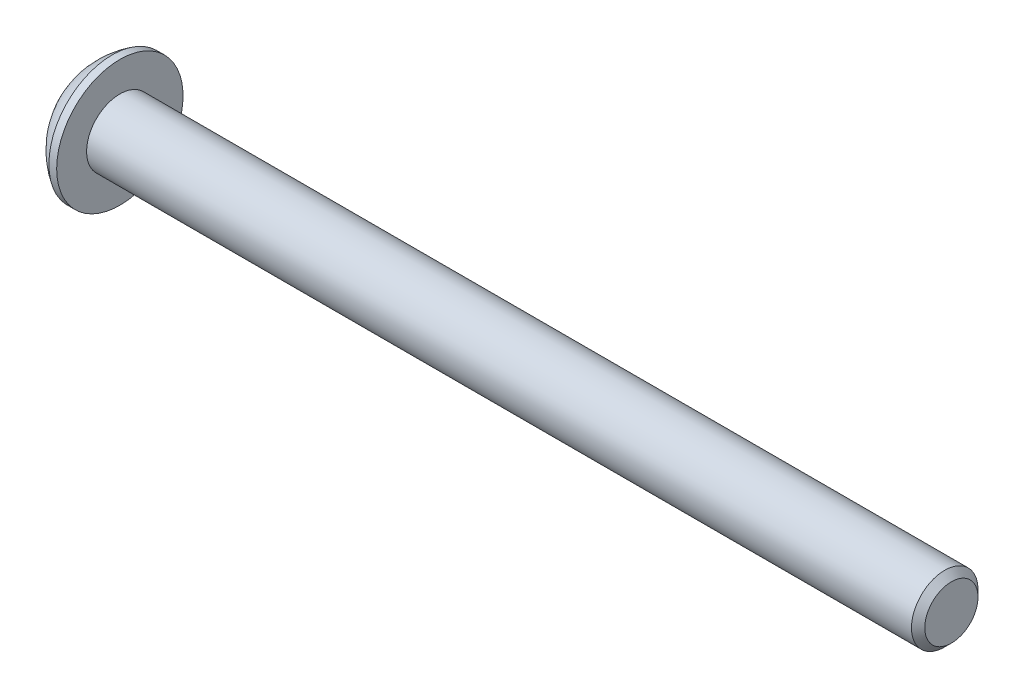
ISO-10303-21;
HEADER;
FILE_DESCRIPTION(('STEP AP214'),'2;1');
FILE_NAME('part.step','',(''),(''),'','','');
FILE_SCHEMA(('AUTOMOTIVE_DESIGN { 1 0 10303 214 1 1 1 1 }'));
ENDSEC;
DATA;
#1=APPLICATION_CONTEXT('core data for automotive mechanical design processes');
#2=APPLICATION_PROTOCOL_DEFINITION('international standard','automotive_design',2000,#1);
#3=PRODUCT_CONTEXT('',#1,'mechanical');
#4=PRODUCT('Part','Part','',(#3));
#5=PRODUCT_RELATED_PRODUCT_CATEGORY('part','',(#4));
#6=PRODUCT_DEFINITION_FORMATION('','',#4);
#7=PRODUCT_DEFINITION_CONTEXT('part definition',#1,'design');
#8=PRODUCT_DEFINITION('design','',#6,#7);
#9=PRODUCT_DEFINITION_SHAPE('','',#8);
#10=(LENGTH_UNIT() NAMED_UNIT(*) SI_UNIT(.MILLI.,.METRE.));
#11=(NAMED_UNIT(*) PLANE_ANGLE_UNIT() SI_UNIT($,.RADIAN.));
#12=(NAMED_UNIT(*) SI_UNIT($,.STERADIAN.) SOLID_ANGLE_UNIT());
#13=UNCERTAINTY_MEASURE_WITH_UNIT(LENGTH_MEASURE(1.E-05),#10,'distance_accuracy_value','');
#14=(GEOMETRIC_REPRESENTATION_CONTEXT(3) GLOBAL_UNCERTAINTY_ASSIGNED_CONTEXT((#13)) GLOBAL_UNIT_ASSIGNED_CONTEXT((#10,
#11,#12)) REPRESENTATION_CONTEXT('',''));
#15=CARTESIAN_POINT('',(0.,0.,0.));
#16=DIRECTION('',(0.,0.,1.));
#17=DIRECTION('',(1.,0.,0.));
#18=AXIS2_PLACEMENT_3D('',#15,#16,#17);
#19=CARTESIAN_POINT('',(0.,1.425,0.));
#20=DIRECTION('',(1.,0.,0.));
#21=DIRECTION('',(0.,0.,-1.));
#22=AXIS2_PLACEMENT_3D('',#19,#20,#21);
#23=PLANE('',#22);
#24=DIRECTION('',(0.,-0.00130636826834642,-0.99999914670061));
#25=VECTOR('',#24,1.);
#26=CARTESIAN_POINT('',(0.,1.000753378772,0.576043408268644));
#27=LINE('',#26,#25);
#28=CARTESIAN_POINT('',(0.,1.000753378772,0.576043408268644));
#29=VERTEX_POINT('',#28);
#30=CARTESIAN_POINT('',(0.,0.999244914629214,-0.578656144805337));
#31=VERTEX_POINT('',#30);
#32=EDGE_CURVE('E123',#29,#31,#27,.T.);
#33=ORIENTED_EDGE('',*,*,#32,.F.);
#34=DIRECTION('',(0.,0.865371480671316,-0.501130921457391));
#35=VECTOR('',#34,1.);
#36=CARTESIAN_POINT('',(0.,0.00150846414278118,1.15469955307398));
#37=LINE('',#36,#35);
#38=CARTESIAN_POINT('',(0.,0.00150846414278118,1.15469955307398));
#39=VERTEX_POINT('',#38);
#40=EDGE_CURVE('E49',#39,#29,#37,.T.);
#41=ORIENTED_EDGE('',*,*,#40,.F.);
#42=DIRECTION('',(0.,0.866677848939663,0.498868225243219));
#43=VECTOR('',#42,1.);
#44=CARTESIAN_POINT('',(0.,-0.999244914629214,0.578656144805337));
#45=LINE('',#44,#43);
#46=CARTESIAN_POINT('',(0.,-0.999244914629214,0.578656144805337));
#47=VERTEX_POINT('',#46);
#48=EDGE_CURVE('E132',#47,#39,#45,.T.);
#49=ORIENTED_EDGE('',*,*,#48,.F.);
#50=DIRECTION('',(0.,0.00130636826834661,0.99999914670061));
#51=VECTOR('',#50,1.);
#52=CARTESIAN_POINT('',(0.,-1.000753378772,-0.576043408268644));
#53=LINE('',#52,#51);
#54=CARTESIAN_POINT('',(0.,-1.000753378772,-0.576043408268644));
#55=VERTEX_POINT('',#54);
#56=EDGE_CURVE('E130',#55,#47,#53,.T.);
#57=ORIENTED_EDGE('',*,*,#56,.F.);
#58=DIRECTION('',(0.,-0.865371480671316,0.501130921457391));
#59=VECTOR('',#58,1.);
#60=CARTESIAN_POINT('',(0.,-0.00150846414278128,-1.15469955307398));
#61=LINE('',#60,#59);
#62=CARTESIAN_POINT('',(0.,-0.00150846414278128,-1.15469955307398));
#63=VERTEX_POINT('',#62);
#64=EDGE_CURVE('E97',#63,#55,#61,.T.);
#65=ORIENTED_EDGE('',*,*,#64,.F.);
#66=DIRECTION('',(0.,-0.866677848939663,-0.498868225243219));
#67=VECTOR('',#66,1.);
#68=CARTESIAN_POINT('',(0.,0.999244914629214,-0.578656144805337));
#69=LINE('',#68,#67);
#70=EDGE_CURVE('E126',#31,#63,#69,.T.);
#71=ORIENTED_EDGE('',*,*,#70,.F.);
#72=EDGE_LOOP('',(#33,#41,#49,#57,#65,#71));
#73=FACE_BOUND('',#72,.T.);
#74=CARTESIAN_POINT('',(0.,0.,0.));
#75=DIRECTION('',(-1.,0.,0.));
#76=DIRECTION('',(0.,0.,1.));
#77=AXIS2_PLACEMENT_3D('',#74,#75,#76);
#78=CIRCLE('',#77,1.425);
#79=CARTESIAN_POINT('',(0.,0.,1.425));
#80=VERTEX_POINT('',#79);
#81=EDGE_CURVE('E136',#80,#80,#78,.T.);
#82=ORIENTED_EDGE('',*,*,#81,.T.);
#83=EDGE_LOOP('',(#82));
#84=FACE_BOUND('',#83,.T.);
#85=ADVANCED_FACE('F34',(#73,#84),#23,.F.);
#86=CARTESIAN_POINT('',(39.15,0.,0.));
#87=DIRECTION('',(-1.,0.,0.));
#88=DIRECTION('',(0.,0.,1.));
#89=AXIS2_PLACEMENT_3D('',#86,#87,#88);
#90=PLANE('',#89);
#91=CARTESIAN_POINT('',(39.15,0.,0.));
#92=DIRECTION('',(-1.,0.,0.));
#93=DIRECTION('',(0.,0.,1.));
#94=AXIS2_PLACEMENT_3D('',#91,#92,#93);
#95=CIRCLE('',#94,1.20000000000001);
#96=CARTESIAN_POINT('',(39.15,0.,1.20000000000001));
#97=VERTEX_POINT('',#96);
#98=EDGE_CURVE('E11',#97,#97,#95,.F.);
#99=ORIENTED_EDGE('',*,*,#98,.T.);
#100=EDGE_LOOP('',(#99));
#101=FACE_BOUND('',#100,.T.);
#102=ADVANCED_FACE('F173',(#101),#90,.F.);
#103=CARTESIAN_POINT('',(0.,0.,0.));
#104=DIRECTION('',(-1.,0.,0.));
#105=DIRECTION('',(0.,0.,1.));
#106=AXIS2_PLACEMENT_3D('',#103,#104,#105);
#107=CYLINDRICAL_SURFACE('',#106,1.5);
#108=CARTESIAN_POINT('',(38.85,0.,0.));
#109=DIRECTION('',(-1.,0.,0.));
#110=DIRECTION('',(0.,0.,1.));
#111=AXIS2_PLACEMENT_3D('',#108,#109,#110);
#112=CIRCLE('',#111,1.5);
#113=CARTESIAN_POINT('',(38.85,0.,1.5));
#114=VERTEX_POINT('',#113);
#115=EDGE_CURVE('E42',#114,#114,#112,.T.);
#116=ORIENTED_EDGE('',*,*,#115,.T.);
#117=EDGE_LOOP('',(#116));
#118=FACE_BOUND('',#117,.T.);
#119=CARTESIAN_POINT('',(1.65,0.,0.));
#120=DIRECTION('',(-1.,0.,0.));
#121=DIRECTION('',(0.,0.,1.));
#122=AXIS2_PLACEMENT_3D('',#119,#120,#121);
#123=CIRCLE('',#122,1.5);
#124=CARTESIAN_POINT('',(1.65,0.,1.5));
#125=VERTEX_POINT('',#124);
#126=EDGE_CURVE('E150',#125,#125,#123,.T.);
#127=ORIENTED_EDGE('',*,*,#126,.F.);
#128=EDGE_LOOP('',(#127));
#129=FACE_BOUND('',#128,.T.);
#130=ADVANCED_FACE('F155',(#118,#129),#107,.T.);
#131=CARTESIAN_POINT('',(1.65,1.5,0.));
#132=DIRECTION('',(-1.,0.,0.));
#133=DIRECTION('',(0.,0.,1.));
#134=AXIS2_PLACEMENT_3D('',#131,#132,#133);
#135=PLANE('',#134);
#136=CARTESIAN_POINT('',(1.65,0.,0.));
#137=DIRECTION('',(-1.,0.,0.));
#138=DIRECTION('',(0.,0.,1.));
#139=AXIS2_PLACEMENT_3D('',#136,#137,#138);
#140=CIRCLE('',#139,2.85);
#141=CARTESIAN_POINT('',(1.65,0.,2.85));
#142=VERTEX_POINT('',#141);
#143=EDGE_CURVE('E147',#142,#142,#140,.T.);
#144=ORIENTED_EDGE('',*,*,#143,.F.);
#145=EDGE_LOOP('',(#144));
#146=FACE_BOUND('',#145,.T.);
#147=ORIENTED_EDGE('',*,*,#126,.T.);
#148=EDGE_LOOP('',(#147));
#149=FACE_BOUND('',#148,.T.);
#150=ADVANCED_FACE('F185',(#146,#149),#135,.F.);
#151=CARTESIAN_POINT('',(0.,0.,0.));
#152=DIRECTION('',(-1.,0.,0.));
#153=DIRECTION('',(0.,0.,1.));
#154=AXIS2_PLACEMENT_3D('',#151,#152,#153);
#155=CYLINDRICAL_SURFACE('',#154,2.85);
#156=CARTESIAN_POINT('',(1.3,0.,0.));
#157=DIRECTION('',(-1.,0.,0.));
#158=DIRECTION('',(0.,0.,1.));
#159=AXIS2_PLACEMENT_3D('',#156,#157,#158);
#160=CIRCLE('',#159,2.85);
#161=CARTESIAN_POINT('',(1.3,0.,2.85));
#162=VERTEX_POINT('',#161);
#163=EDGE_CURVE('E144',#162,#162,#160,.T.);
#164=ORIENTED_EDGE('',*,*,#163,.F.);
#165=EDGE_LOOP('',(#164));
#166=FACE_BOUND('',#165,.T.);
#167=ORIENTED_EDGE('',*,*,#143,.T.);
#168=EDGE_LOOP('',(#167));
#169=FACE_BOUND('',#168,.T.);
#170=ADVANCED_FACE('F168',(#166,#169),#155,.T.);
#171=CARTESIAN_POINT('',(3.13557647887669,0.,0.));
#172=DIRECTION('',(-1.,0.,0.));
#173=DIRECTION('',(0.,0.,1.));
#174=AXIS2_PLACEMENT_3D('',#171,#172,#173);
#175=DEGENERATE_TOROIDAL_SURFACE('',#174,0.13004345441382,3.5,.F.);
#176=ORIENTED_EDGE('',*,*,#81,.F.);
#177=EDGE_LOOP('',(#176));
#178=FACE_BOUND('',#177,.T.);
#179=ORIENTED_EDGE('',*,*,#163,.T.);
#180=EDGE_LOOP('',(#179));
#181=FACE_BOUND('',#180,.T.);
#182=ADVANCED_FACE('F160',(#178,#181),#175,.F.);
#183=CARTESIAN_POINT('',(38.85,0.,0.));
#184=DIRECTION('',(-1.,0.,0.));
#185=DIRECTION('',(0.,0.,1.));
#186=AXIS2_PLACEMENT_3D('',#183,#184,#185);
#187=CONICAL_SURFACE('',#186,1.5,0.785398163397453);
#188=ORIENTED_EDGE('',*,*,#98,.F.);
#189=EDGE_LOOP('',(#188));
#190=FACE_BOUND('',#189,.T.);
#191=ORIENTED_EDGE('',*,*,#115,.F.);
#192=EDGE_LOOP('',(#191));
#193=FACE_BOUND('',#192,.T.);
#194=ADVANCED_FACE('F36',(#190,#193),#187,.T.);
#195=CARTESIAN_POINT('',(1.,0.00150846414278118,1.15469955307398));
#196=DIRECTION('',(0.,0.501130921457391,0.865371480671316));
#197=DIRECTION('',(0.,-0.865371480671316,0.501130921457391));
#198=AXIS2_PLACEMENT_3D('',#195,#196,#197);
#199=PLANE('',#198);
#200=ORIENTED_EDGE('',*,*,#40,.T.);
#201=DIRECTION('',(-1.,0.,0.));
#202=VECTOR('',#201,1.);
#203=CARTESIAN_POINT('',(1.,1.000753378772,0.576043408268644));
#204=LINE('',#203,#202);
#205=CARTESIAN_POINT('',(1.,1.000753378772,0.576043408268644));
#206=VERTEX_POINT('',#205);
#207=EDGE_CURVE('E79',#206,#29,#204,.T.);
#208=ORIENTED_EDGE('',*,*,#207,.F.);
#209=DIRECTION('',(0.,0.865371480671316,-0.501130921457391));
#210=VECTOR('',#209,1.);
#211=CARTESIAN_POINT('',(1.,0.00150846414278118,1.15469955307398));
#212=LINE('',#211,#210);
#213=CARTESIAN_POINT('',(1.,0.00150846414278118,1.15469955307398));
#214=VERTEX_POINT('',#213);
#215=EDGE_CURVE('E134',#214,#206,#212,.T.);
#216=ORIENTED_EDGE('',*,*,#215,.F.);
#217=DIRECTION('',(-1.,0.,0.));
#218=VECTOR('',#217,1.);
#219=CARTESIAN_POINT('',(1.,0.00150846414278118,1.15469955307398));
#220=LINE('',#219,#218);
#221=EDGE_CURVE('E57',#214,#39,#220,.T.);
#222=ORIENTED_EDGE('',*,*,#221,.T.);
#223=EDGE_LOOP('',(#200,#208,#216,#222));
#224=FACE_BOUND('',#223,.T.);
#225=ADVANCED_FACE('F159',(#224),#199,.F.);
#226=CARTESIAN_POINT('',(1.,-0.999244914629214,0.578656144805337));
#227=DIRECTION('',(0.,-0.498868225243219,0.866677848939663));
#228=DIRECTION('',(0.,-0.866677848939663,-0.498868225243219));
#229=AXIS2_PLACEMENT_3D('',#226,#227,#228);
#230=PLANE('',#229);
#231=ORIENTED_EDGE('',*,*,#48,.T.);
#232=ORIENTED_EDGE('',*,*,#221,.F.);
#233=DIRECTION('',(0.,0.866677848939663,0.498868225243219));
#234=VECTOR('',#233,1.);
#235=CARTESIAN_POINT('',(1.,-0.999244914629214,0.578656144805337));
#236=LINE('',#235,#234);
#237=CARTESIAN_POINT('',(1.,-0.999244914629214,0.578656144805337));
#238=VERTEX_POINT('',#237);
#239=EDGE_CURVE('E109',#238,#214,#236,.T.);
#240=ORIENTED_EDGE('',*,*,#239,.F.);
#241=DIRECTION('',(-1.,0.,0.));
#242=VECTOR('',#241,1.);
#243=CARTESIAN_POINT('',(1.,-0.999244914629214,0.578656144805337));
#244=LINE('',#243,#242);
#245=EDGE_CURVE('E101',#238,#47,#244,.T.);
#246=ORIENTED_EDGE('',*,*,#245,.T.);
#247=EDGE_LOOP('',(#231,#232,#240,#246));
#248=FACE_BOUND('',#247,.T.);
#249=ADVANCED_FACE('F166',(#248),#230,.F.);
#250=CARTESIAN_POINT('',(1.,-1.000753378772,-0.576043408268644));
#251=DIRECTION('',(0.,-0.99999914670061,0.00130636826834661));
#252=DIRECTION('',(0.,-0.00130636826834661,-0.99999914670061));
#253=AXIS2_PLACEMENT_3D('',#250,#251,#252);
#254=PLANE('',#253);
#255=ORIENTED_EDGE('',*,*,#56,.T.);
#256=ORIENTED_EDGE('',*,*,#245,.F.);
#257=DIRECTION('',(0.,0.00130636826834661,0.99999914670061));
#258=VECTOR('',#257,1.);
#259=CARTESIAN_POINT('',(1.,-1.000753378772,-0.576043408268644));
#260=LINE('',#259,#258);
#261=CARTESIAN_POINT('',(1.,-1.000753378772,-0.576043408268644));
#262=VERTEX_POINT('',#261);
#263=EDGE_CURVE('E105',#262,#238,#260,.T.);
#264=ORIENTED_EDGE('',*,*,#263,.F.);
#265=DIRECTION('',(-1.,0.,0.));
#266=VECTOR('',#265,1.);
#267=CARTESIAN_POINT('',(1.,-1.000753378772,-0.576043408268644));
#268=LINE('',#267,#266);
#269=EDGE_CURVE('E90',#262,#55,#268,.T.);
#270=ORIENTED_EDGE('',*,*,#269,.T.);
#271=EDGE_LOOP('',(#255,#256,#264,#270));
#272=FACE_BOUND('',#271,.T.);
#273=ADVANCED_FACE('F106',(#272),#254,.F.);
#274=CARTESIAN_POINT('',(1.,-0.00150846414278128,-1.15469955307398));
#275=DIRECTION('',(0.,-0.501130921457391,-0.865371480671316));
#276=DIRECTION('',(0.,0.865371480671316,-0.501130921457391));
#277=AXIS2_PLACEMENT_3D('',#274,#275,#276);
#278=PLANE('',#277);
#279=ORIENTED_EDGE('',*,*,#64,.T.);
#280=ORIENTED_EDGE('',*,*,#269,.F.);
#281=DIRECTION('',(0.,-0.865371480671316,0.501130921457391));
#282=VECTOR('',#281,1.);
#283=CARTESIAN_POINT('',(1.,-0.00150846414278128,-1.15469955307398));
#284=LINE('',#283,#282);
#285=CARTESIAN_POINT('',(1.,-0.00150846414278128,-1.15469955307398));
#286=VERTEX_POINT('',#285);
#287=EDGE_CURVE('E94',#286,#262,#284,.T.);
#288=ORIENTED_EDGE('',*,*,#287,.F.);
#289=DIRECTION('',(-1.,0.,0.));
#290=VECTOR('',#289,1.);
#291=CARTESIAN_POINT('',(1.,-0.00150846414278128,-1.15469955307398));
#292=LINE('',#291,#290);
#293=EDGE_CURVE('E102',#286,#63,#292,.T.);
#294=ORIENTED_EDGE('',*,*,#293,.T.);
#295=EDGE_LOOP('',(#279,#280,#288,#294));
#296=FACE_BOUND('',#295,.T.);
#297=ADVANCED_FACE('F92',(#296),#278,.F.);
#298=CARTESIAN_POINT('',(1.,0.999244914629214,-0.578656144805337));
#299=DIRECTION('',(0.,0.498868225243219,-0.866677848939663));
#300=DIRECTION('',(0.,0.866677848939663,0.498868225243219));
#301=AXIS2_PLACEMENT_3D('',#298,#299,#300);
#302=PLANE('',#301);
#303=ORIENTED_EDGE('',*,*,#70,.T.);
#304=ORIENTED_EDGE('',*,*,#293,.F.);
#305=DIRECTION('',(0.,-0.866677848939663,-0.498868225243219));
#306=VECTOR('',#305,1.);
#307=CARTESIAN_POINT('',(1.,0.999244914629214,-0.578656144805337));
#308=LINE('',#307,#306);
#309=CARTESIAN_POINT('',(1.,0.999244914629214,-0.578656144805337));
#310=VERTEX_POINT('',#309);
#311=EDGE_CURVE('E115',#310,#286,#308,.T.);
#312=ORIENTED_EDGE('',*,*,#311,.F.);
#313=DIRECTION('',(-1.,0.,0.));
#314=VECTOR('',#313,1.);
#315=CARTESIAN_POINT('',(1.,0.999244914629214,-0.578656144805337));
#316=LINE('',#315,#314);
#317=EDGE_CURVE('E139',#310,#31,#316,.T.);
#318=ORIENTED_EDGE('',*,*,#317,.T.);
#319=EDGE_LOOP('',(#303,#304,#312,#318));
#320=FACE_BOUND('',#319,.T.);
#321=ADVANCED_FACE('F195',(#320),#302,.F.);
#322=CARTESIAN_POINT('',(1.,1.000753378772,0.576043408268644));
#323=DIRECTION('',(0.,0.99999914670061,-0.00130636826834642));
#324=DIRECTION('',(0.,0.00130636826834642,0.99999914670061));
#325=AXIS2_PLACEMENT_3D('',#322,#323,#324);
#326=PLANE('',#325);
#327=ORIENTED_EDGE('',*,*,#32,.T.);
#328=ORIENTED_EDGE('',*,*,#317,.F.);
#329=DIRECTION('',(0.,-0.00130636826834642,-0.99999914670061));
#330=VECTOR('',#329,1.);
#331=CARTESIAN_POINT('',(1.,1.000753378772,0.576043408268644));
#332=LINE('',#331,#330);
#333=EDGE_CURVE('E117',#206,#310,#332,.T.);
#334=ORIENTED_EDGE('',*,*,#333,.F.);
#335=ORIENTED_EDGE('',*,*,#207,.T.);
#336=EDGE_LOOP('',(#327,#328,#334,#335));
#337=FACE_BOUND('',#336,.T.);
#338=ADVANCED_FACE('F192',(#337),#326,.F.);
#339=CARTESIAN_POINT('',(1.,0.,0.));
#340=DIRECTION('',(-1.,0.,0.));
#341=DIRECTION('',(0.,0.,1.));
#342=AXIS2_PLACEMENT_3D('',#339,#340,#341);
#343=PLANE('',#342);
#344=ORIENTED_EDGE('',*,*,#215,.T.);
#345=ORIENTED_EDGE('',*,*,#333,.T.);
#346=ORIENTED_EDGE('',*,*,#311,.T.);
#347=ORIENTED_EDGE('',*,*,#287,.T.);
#348=ORIENTED_EDGE('',*,*,#263,.T.);
#349=ORIENTED_EDGE('',*,*,#239,.T.);
#350=EDGE_LOOP('',(#344,#345,#346,#347,#348,#349));
#351=FACE_BOUND('',#350,.T.);
#352=ADVANCED_FACE('F112',(#351),#343,.T.);
#353=CLOSED_SHELL('',(#85,#102,#130,#150,#170,#182,#194,#225,#249,#273,#297,#321,#338,#352));
#354=MANIFOLD_SOLID_BREP('B2',#353);
#355=ADVANCED_BREP_SHAPE_REPRESENTATION('',(#18,#354),#14);
#356=SHAPE_DEFINITION_REPRESENTATION(#9,#355);
ENDSEC;
END-ISO-10303-21;
